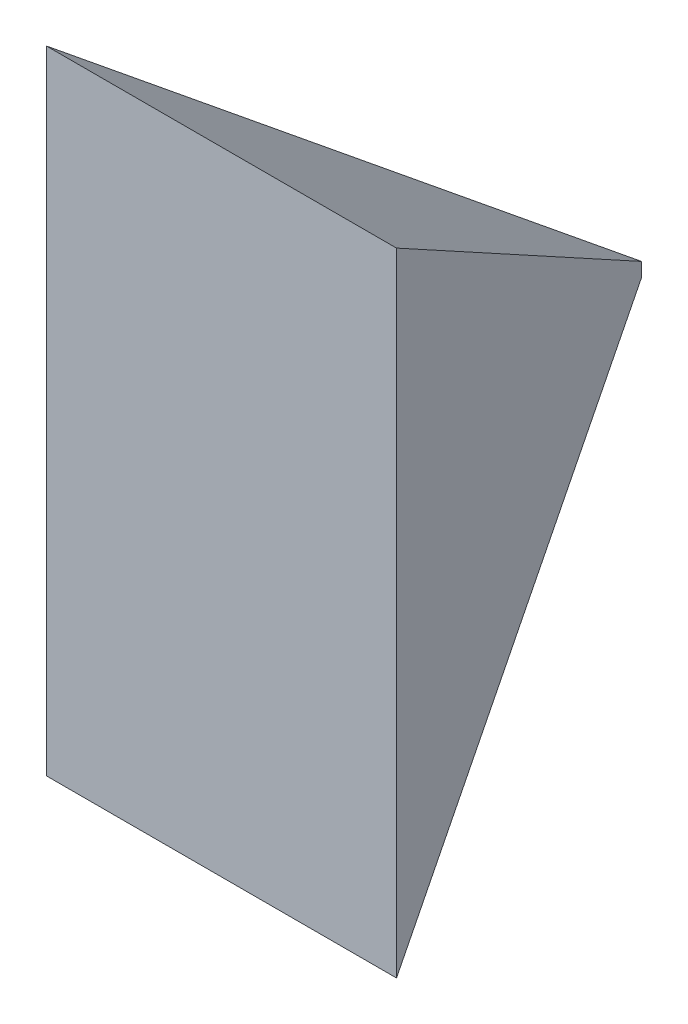
ISO-10303-21;
HEADER;
FILE_DESCRIPTION(('STEP AP214'),'2;1');
FILE_NAME('part.step','',(''),(''),'','','');
FILE_SCHEMA(('AUTOMOTIVE_DESIGN { 1 0 10303 214 1 1 1 1 }'));
ENDSEC;
DATA;
#1=APPLICATION_CONTEXT('core data for automotive mechanical design processes');
#2=APPLICATION_PROTOCOL_DEFINITION('international standard','automotive_design',2000,#1);
#3=PRODUCT_CONTEXT('',#1,'mechanical');
#4=PRODUCT('Part','Part','',(#3));
#5=PRODUCT_RELATED_PRODUCT_CATEGORY('part','',(#4));
#6=PRODUCT_DEFINITION_FORMATION('','',#4);
#7=PRODUCT_DEFINITION_CONTEXT('part definition',#1,'design');
#8=PRODUCT_DEFINITION('design','',#6,#7);
#9=PRODUCT_DEFINITION_SHAPE('','',#8);
#10=(LENGTH_UNIT() NAMED_UNIT(*) SI_UNIT(.MILLI.,.METRE.));
#11=(NAMED_UNIT(*) PLANE_ANGLE_UNIT() SI_UNIT($,.RADIAN.));
#12=(NAMED_UNIT(*) SI_UNIT($,.STERADIAN.) SOLID_ANGLE_UNIT());
#13=UNCERTAINTY_MEASURE_WITH_UNIT(LENGTH_MEASURE(1.E-05),#10,'distance_accuracy_value','');
#14=(GEOMETRIC_REPRESENTATION_CONTEXT(3) GLOBAL_UNCERTAINTY_ASSIGNED_CONTEXT((#13)) GLOBAL_UNIT_ASSIGNED_CONTEXT((#10,
#11,#12)) REPRESENTATION_CONTEXT('',''));
#15=CARTESIAN_POINT('',(0.,0.,0.));
#16=DIRECTION('',(0.,0.,1.));
#17=DIRECTION('',(1.,0.,0.));
#18=AXIS2_PLACEMENT_3D('',#15,#16,#17);
#19=CARTESIAN_POINT('',(12.5,45.15,0.));
#20=DIRECTION('',(0.,0.,-1.));
#21=DIRECTION('',(-1.,0.,0.));
#22=AXIS2_PLACEMENT_3D('',#19,#20,#21);
#23=PLANE('',#22);
#24=DIRECTION('',(1.,0.,0.));
#25=VECTOR('',#24,1.);
#26=CARTESIAN_POINT('',(12.5,0.,0.));
#27=LINE('',#26,#25);
#28=CARTESIAN_POINT('',(-12.5,0.,0.));
#29=VERTEX_POINT('',#28);
#30=CARTESIAN_POINT('',(12.5,0.,0.));
#31=VERTEX_POINT('',#30);
#32=EDGE_CURVE('E58',#29,#31,#27,.T.);
#33=ORIENTED_EDGE('',*,*,#32,.T.);
#34=DIRECTION('',(0.,-1.,0.));
#35=VECTOR('',#34,1.);
#36=CARTESIAN_POINT('',(12.5,45.15,0.));
#37=LINE('',#36,#35);
#38=CARTESIAN_POINT('',(12.5,45.15,0.));
#39=VERTEX_POINT('',#38);
#40=EDGE_CURVE('E81',#39,#31,#37,.T.);
#41=ORIENTED_EDGE('',*,*,#40,.F.);
#42=DIRECTION('',(1.,0.,0.));
#43=VECTOR('',#42,1.);
#44=CARTESIAN_POINT('',(12.5,45.15,0.));
#45=LINE('',#44,#43);
#46=CARTESIAN_POINT('',(-12.5,45.15,0.));
#47=VERTEX_POINT('',#46);
#48=EDGE_CURVE('E68',#47,#39,#45,.T.);
#49=ORIENTED_EDGE('',*,*,#48,.F.);
#50=DIRECTION('',(0.,-1.,0.));
#51=VECTOR('',#50,1.);
#52=CARTESIAN_POINT('',(-12.5,45.15,0.));
#53=LINE('',#52,#51);
#54=EDGE_CURVE('E78',#47,#29,#53,.T.);
#55=ORIENTED_EDGE('',*,*,#54,.T.);
#56=EDGE_LOOP('',(#33,#41,#49,#55));
#57=FACE_BOUND('',#56,.T.);
#58=ADVANCED_FACE('F39',(#57),#23,.F.);
#59=CARTESIAN_POINT('',(0.,45.15,-30.));
#60=DIRECTION('',(-0.923076923076923,0.,0.384615384615385));
#61=DIRECTION('',(0.384615384615385,0.,0.923076923076923));
#62=AXIS2_PLACEMENT_3D('',#59,#60,#61);
#63=PLANE('',#62);
#64=DIRECTION('',(0.,-1.,0.));
#65=VECTOR('',#64,1.);
#66=CARTESIAN_POINT('',(0.,45.15,-30.));
#67=LINE('',#66,#65);
#68=CARTESIAN_POINT('',(0.,23.075,-30.));
#69=VERTEX_POINT('',#68);
#70=CARTESIAN_POINT('',(0.,22.075,-30.));
#71=VERTEX_POINT('',#70);
#72=EDGE_CURVE('E83',#69,#71,#67,.T.);
#73=ORIENTED_EDGE('',*,*,#72,.F.);
#74=DIRECTION('',(0.318162412181221,0.561874819912036,0.76358978923493));
#75=VECTOR('',#74,1.);
#76=CARTESIAN_POINT('',(3.94629141563978,30.0441506400199,-20.5289006024645));
#77=LINE('',#76,#75);
#78=EDGE_CURVE('E52',#69,#39,#77,.T.);
#79=ORIENTED_EDGE('',*,*,#78,.T.);
#80=ORIENTED_EDGE('',*,*,#40,.T.);
#81=DIRECTION('',(-0.318162412181221,0.561874819912036,-0.76358978923493));
#82=VECTOR('',#81,1.);
#83=CARTESIAN_POINT('',(-4.12505886368688,29.359853953271,-39.9001412728485));
#84=LINE('',#83,#82);
#85=EDGE_CURVE('E89',#31,#71,#84,.T.);
#86=ORIENTED_EDGE('',*,*,#85,.T.);
#87=EDGE_LOOP('',(#73,#79,#80,#86));
#88=FACE_BOUND('',#87,.T.);
#89=ADVANCED_FACE('F82',(#88),#63,.F.);
#90=CARTESIAN_POINT('',(-12.5,45.15,0.));
#91=DIRECTION('',(0.923076923076923,0.,0.384615384615385));
#92=DIRECTION('',(0.384615384615385,0.,-0.923076923076923));
#93=AXIS2_PLACEMENT_3D('',#90,#91,#92);
#94=PLANE('',#93);
#95=ORIENTED_EDGE('',*,*,#54,.F.);
#96=DIRECTION('',(0.318162412181221,-0.561874819912036,-0.76358978923493));
#97=VECTOR('',#96,1.);
#98=CARTESIAN_POINT('',(-12.5,45.15,0.));
#99=LINE('',#98,#97);
#100=EDGE_CURVE('E11',#47,#69,#99,.T.);
#101=ORIENTED_EDGE('',*,*,#100,.T.);
#102=ORIENTED_EDGE('',*,*,#72,.T.);
#103=DIRECTION('',(-0.318162412181221,-0.561874819912036,0.76358978923493));
#104=VECTOR('',#103,1.);
#105=CARTESIAN_POINT('',(-4.42864972067334,14.2540045932909,-19.371240670384));
#106=LINE('',#105,#104);
#107=EDGE_CURVE('E46',#71,#29,#106,.T.);
#108=ORIENTED_EDGE('',*,*,#107,.T.);
#109=EDGE_LOOP('',(#95,#101,#102,#108));
#110=FACE_BOUND('',#109,.T.);
#111=ADVANCED_FACE('F91',(#110),#94,.F.);
#112=CARTESIAN_POINT('',(-12.5,22.075,-30.));
#113=DIRECTION('',(0.,0.805443685572082,0.59267231196679));
#114=DIRECTION('',(0.,-0.59267231196679,0.805443685572082));
#115=AXIS2_PLACEMENT_3D('',#112,#113,#114);
#116=PLANE('',#115);
#117=ORIENTED_EDGE('',*,*,#32,.F.);
#118=ORIENTED_EDGE('',*,*,#107,.F.);
#119=ORIENTED_EDGE('',*,*,#85,.F.);
#120=EDGE_LOOP('',(#117,#118,#119));
#121=FACE_BOUND('',#120,.T.);
#122=ADVANCED_FACE('F93',(#121),#116,.F.);
#123=CARTESIAN_POINT('',(-12.5,45.15,0.));
#124=DIRECTION('',(0.,-0.805443685572082,0.59267231196679));
#125=DIRECTION('',(0.,-0.59267231196679,-0.805443685572082));
#126=AXIS2_PLACEMENT_3D('',#123,#124,#125);
#127=PLANE('',#126);
#128=ORIENTED_EDGE('',*,*,#100,.F.);
#129=ORIENTED_EDGE('',*,*,#48,.T.);
#130=ORIENTED_EDGE('',*,*,#78,.F.);
#131=EDGE_LOOP('',(#128,#129,#130));
#132=FACE_BOUND('',#131,.T.);
#133=ADVANCED_FACE('F72',(#132),#127,.F.);
#134=CLOSED_SHELL('',(#58,#89,#111,#122,#133));
#135=MANIFOLD_SOLID_BREP('B2',#134);
#136=ADVANCED_BREP_SHAPE_REPRESENTATION('',(#18,#135),#14);
#137=SHAPE_DEFINITION_REPRESENTATION(#9,#136);
ENDSEC;
END-ISO-10303-21;
